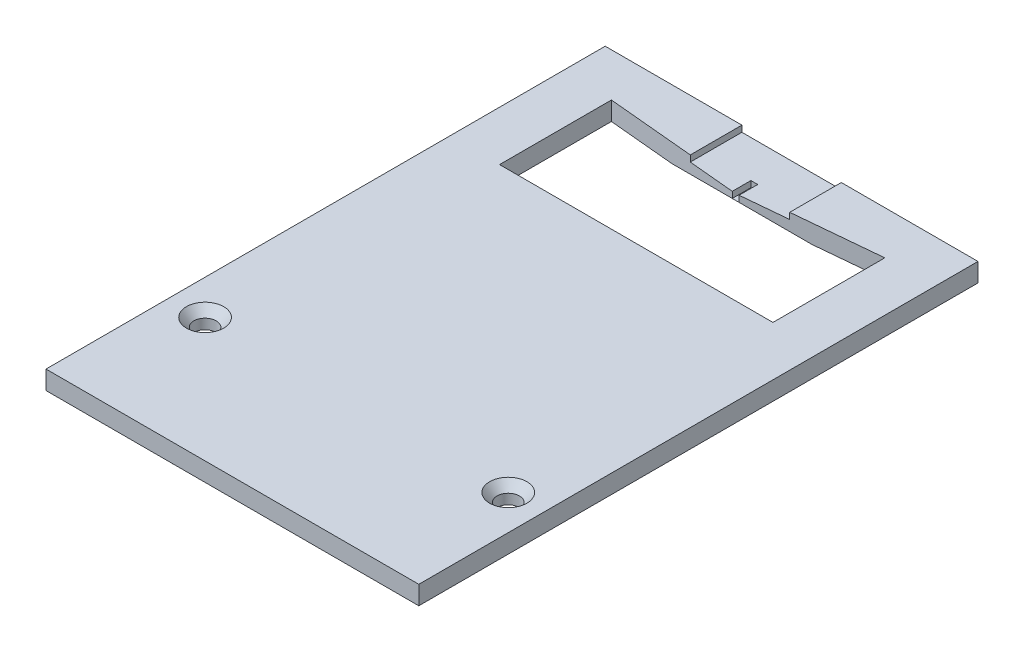
ISO-10303-21;
HEADER;
FILE_DESCRIPTION(('STEP AP214'),'2;1');
FILE_NAME('part.step','',(''),(''),'','','');
FILE_SCHEMA(('AUTOMOTIVE_DESIGN { 1 0 10303 214 1 1 1 1 }'));
ENDSEC;
DATA;
#1=APPLICATION_CONTEXT('core data for automotive mechanical design processes');
#2=APPLICATION_PROTOCOL_DEFINITION('international standard','automotive_design',2000,#1);
#3=PRODUCT_CONTEXT('',#1,'mechanical');
#4=PRODUCT('Part','Part','',(#3));
#5=PRODUCT_RELATED_PRODUCT_CATEGORY('part','',(#4));
#6=PRODUCT_DEFINITION_FORMATION('','',#4);
#7=PRODUCT_DEFINITION_CONTEXT('part definition',#1,'design');
#8=PRODUCT_DEFINITION('design','',#6,#7);
#9=PRODUCT_DEFINITION_SHAPE('','',#8);
#10=(LENGTH_UNIT() NAMED_UNIT(*) SI_UNIT(.MILLI.,.METRE.));
#11=(NAMED_UNIT(*) PLANE_ANGLE_UNIT() SI_UNIT($,.RADIAN.));
#12=(NAMED_UNIT(*) SI_UNIT($,.STERADIAN.) SOLID_ANGLE_UNIT());
#13=UNCERTAINTY_MEASURE_WITH_UNIT(LENGTH_MEASURE(1.E-05),#10,'distance_accuracy_value','');
#14=(GEOMETRIC_REPRESENTATION_CONTEXT(3) GLOBAL_UNCERTAINTY_ASSIGNED_CONTEXT((#13)) GLOBAL_UNIT_ASSIGNED_CONTEXT((#10,
#11,#12)) REPRESENTATION_CONTEXT('',''));
#15=CARTESIAN_POINT('',(0.,0.,0.));
#16=DIRECTION('',(0.,0.,1.));
#17=DIRECTION('',(1.,0.,0.));
#18=AXIS2_PLACEMENT_3D('',#15,#16,#17);
#19=CARTESIAN_POINT('',(0.,3.,0.));
#20=DIRECTION('',(0.,-1.,0.));
#21=DIRECTION('',(0.,0.,-1.));
#22=AXIS2_PLACEMENT_3D('',#19,#20,#21);
#23=PLANE('',#22);
#24=CARTESIAN_POINT('',(-24.4,3.,0.));
#25=DIRECTION('',(0.,1.,0.));
#26=DIRECTION('',(0.,0.,1.));
#27=AXIS2_PLACEMENT_3D('',#24,#25,#26);
#28=CIRCLE('',#27,3.);
#29=CARTESIAN_POINT('',(-24.4,3.,3.));
#30=VERTEX_POINT('',#29);
#31=EDGE_CURVE('E197',#30,#30,#28,.T.);
#32=ORIENTED_EDGE('',*,*,#31,.F.);
#33=EDGE_LOOP('',(#32));
#34=FACE_BOUND('',#33,.T.);
#35=CARTESIAN_POINT('',(24.4,3.,0.));
#36=DIRECTION('',(0.,1.,0.));
#37=DIRECTION('',(0.,0.,1.));
#38=AXIS2_PLACEMENT_3D('',#35,#36,#37);
#39=CIRCLE('',#38,3.);
#40=CARTESIAN_POINT('',(24.4,3.,3.));
#41=VERTEX_POINT('',#40);
#42=EDGE_CURVE('E200',#41,#41,#39,.T.);
#43=ORIENTED_EDGE('',*,*,#42,.F.);
#44=EDGE_LOOP('',(#43));
#45=FACE_BOUND('',#44,.T.);
#46=DIRECTION('',(-0.995681281474736,0.,0.09283741552212));
#47=VECTOR('',#46,1.);
#48=CARTESIAN_POINT('',(0.549999999999998,3.,-61.));
#49=LINE('',#48,#47);
#50=CARTESIAN_POINT('',(22.,3.,-63.));
#51=VERTEX_POINT('',#50);
#52=CARTESIAN_POINT('',(8.,3.,-61.6946386946387));
#53=VERTEX_POINT('',#52);
#54=EDGE_CURVE('E159',#51,#53,#49,.T.);
#55=ORIENTED_EDGE('',*,*,#54,.F.);
#56=DIRECTION('',(0.,0.,-1.));
#57=VECTOR('',#56,1.);
#58=CARTESIAN_POINT('',(22.,3.,-61.));
#59=LINE('',#58,#57);
#60=CARTESIAN_POINT('',(22.,3.,-45.));
#61=VERTEX_POINT('',#60);
#62=EDGE_CURVE('E254',#61,#51,#59,.T.);
#63=ORIENTED_EDGE('',*,*,#62,.F.);
#64=DIRECTION('',(1.,0.,0.));
#65=VECTOR('',#64,1.);
#66=CARTESIAN_POINT('',(-22.,3.,-45.));
#67=LINE('',#66,#65);
#68=CARTESIAN_POINT('',(-22.,3.,-45.));
#69=VERTEX_POINT('',#68);
#70=EDGE_CURVE('E251',#69,#61,#67,.T.);
#71=ORIENTED_EDGE('',*,*,#70,.F.);
#72=DIRECTION('',(0.,0.,1.));
#73=VECTOR('',#72,1.);
#74=CARTESIAN_POINT('',(-22.,3.,-61.));
#75=LINE('',#74,#73);
#76=CARTESIAN_POINT('',(-22.,3.,-63.));
#77=VERTEX_POINT('',#76);
#78=EDGE_CURVE('E249',#77,#69,#75,.T.);
#79=ORIENTED_EDGE('',*,*,#78,.F.);
#80=DIRECTION('',(-0.995681281474736,0.,-0.09283741552212));
#81=VECTOR('',#80,1.);
#82=CARTESIAN_POINT('',(-0.549999999999998,3.,-61.));
#83=LINE('',#82,#81);
#84=CARTESIAN_POINT('',(-8.,3.,-61.6946386946387));
#85=VERTEX_POINT('',#84);
#86=EDGE_CURVE('E175',#85,#77,#83,.T.);
#87=ORIENTED_EDGE('',*,*,#86,.F.);
#88=DIRECTION('',(0.,0.,1.));
#89=VECTOR('',#88,1.);
#90=CARTESIAN_POINT('',(-8.,3.,-61.));
#91=LINE('',#90,#89);
#92=CARTESIAN_POINT('',(-8.,3.,-70.));
#93=VERTEX_POINT('',#92);
#94=EDGE_CURVE('E225',#93,#85,#91,.T.);
#95=ORIENTED_EDGE('',*,*,#94,.F.);
#96=DIRECTION('',(-1.,0.,0.));
#97=VECTOR('',#96,1.);
#98=CARTESIAN_POINT('',(30.,3.,-70.));
#99=LINE('',#98,#97);
#100=CARTESIAN_POINT('',(-30.,3.,-70.));
#101=VERTEX_POINT('',#100);
#102=EDGE_CURVE('E274',#93,#101,#99,.T.);
#103=ORIENTED_EDGE('',*,*,#102,.T.);
#104=DIRECTION('',(0.,0.,1.));
#105=VECTOR('',#104,1.);
#106=CARTESIAN_POINT('',(-30.,3.,-20.));
#107=LINE('',#106,#105);
#108=CARTESIAN_POINT('',(-30.,3.,20.));
#109=VERTEX_POINT('',#108);
#110=EDGE_CURVE('E267',#101,#109,#107,.T.);
#111=ORIENTED_EDGE('',*,*,#110,.T.);
#112=DIRECTION('',(1.,0.,0.));
#113=VECTOR('',#112,1.);
#114=CARTESIAN_POINT('',(-30.,3.,20.));
#115=LINE('',#114,#113);
#116=CARTESIAN_POINT('',(30.,3.,20.));
#117=VERTEX_POINT('',#116);
#118=EDGE_CURVE('E269',#109,#117,#115,.T.);
#119=ORIENTED_EDGE('',*,*,#118,.T.);
#120=DIRECTION('',(0.,0.,-1.));
#121=VECTOR('',#120,1.);
#122=CARTESIAN_POINT('',(30.,3.,-20.));
#123=LINE('',#122,#121);
#124=CARTESIAN_POINT('',(30.,3.,-70.));
#125=VERTEX_POINT('',#124);
#126=EDGE_CURVE('E272',#117,#125,#123,.T.);
#127=ORIENTED_EDGE('',*,*,#126,.T.);
#128=CARTESIAN_POINT('',(8.,3.,-70.));
#129=VERTEX_POINT('',#128);
#130=EDGE_CURVE('E275',#125,#129,#99,.T.);
#131=ORIENTED_EDGE('',*,*,#130,.T.);
#132=DIRECTION('',(0.,0.,-1.));
#133=VECTOR('',#132,1.);
#134=CARTESIAN_POINT('',(8.,3.,-61.));
#135=LINE('',#134,#133);
#136=EDGE_CURVE('E235',#53,#129,#135,.T.);
#137=ORIENTED_EDGE('',*,*,#136,.F.);
#138=EDGE_LOOP('',(#55,#63,#71,#79,#87,#95,#103,#111,#119,#127,#131,#137));
#139=FACE_BOUND('',#138,.T.);
#140=ADVANCED_FACE('F35',(#34,#45,#139),#23,.F.);
#141=CARTESIAN_POINT('',(0.,0.,0.));
#142=DIRECTION('',(0.,-1.,0.));
#143=DIRECTION('',(0.,0.,-1.));
#144=AXIS2_PLACEMENT_3D('',#141,#142,#143);
#145=PLANE('',#144);
#146=DIRECTION('',(1.,0.,0.));
#147=VECTOR('',#146,1.);
#148=CARTESIAN_POINT('',(22.,0.,-62.));
#149=LINE('',#148,#147);
#150=CARTESIAN_POINT('',(-11.2749999999997,0.,-62.));
#151=VERTEX_POINT('',#150);
#152=CARTESIAN_POINT('',(11.2750000000001,0.,-62.));
#153=VERTEX_POINT('',#152);
#154=EDGE_CURVE('E50',#151,#153,#149,.T.);
#155=ORIENTED_EDGE('',*,*,#154,.F.);
#156=DIRECTION('',(-0.995681281474736,0.,-0.09283741552212));
#157=VECTOR('',#156,1.);
#158=CARTESIAN_POINT('',(-0.549999999999998,0.,-61.));
#159=LINE('',#158,#157);
#160=CARTESIAN_POINT('',(-22.,0.,-63.));
#161=VERTEX_POINT('',#160);
#162=EDGE_CURVE('E165',#151,#161,#159,.T.);
#163=ORIENTED_EDGE('',*,*,#162,.T.);
#164=DIRECTION('',(0.,0.,1.));
#165=VECTOR('',#164,1.);
#166=CARTESIAN_POINT('',(-22.,0.,-61.));
#167=LINE('',#166,#165);
#168=CARTESIAN_POINT('',(-22.,0.,-45.));
#169=VERTEX_POINT('',#168);
#170=EDGE_CURVE('E246',#161,#169,#167,.T.);
#171=ORIENTED_EDGE('',*,*,#170,.T.);
#172=DIRECTION('',(1.,0.,0.));
#173=VECTOR('',#172,1.);
#174=CARTESIAN_POINT('',(-22.,0.,-45.));
#175=LINE('',#174,#173);
#176=CARTESIAN_POINT('',(22.,0.,-45.));
#177=VERTEX_POINT('',#176);
#178=EDGE_CURVE('E258',#169,#177,#175,.T.);
#179=ORIENTED_EDGE('',*,*,#178,.T.);
#180=DIRECTION('',(0.,0.,-1.));
#181=VECTOR('',#180,1.);
#182=CARTESIAN_POINT('',(22.,0.,-61.));
#183=LINE('',#182,#181);
#184=CARTESIAN_POINT('',(22.,0.,-63.));
#185=VERTEX_POINT('',#184);
#186=EDGE_CURVE('E252',#177,#185,#183,.T.);
#187=ORIENTED_EDGE('',*,*,#186,.T.);
#188=DIRECTION('',(-0.995681281474736,0.,0.09283741552212));
#189=VECTOR('',#188,1.);
#190=CARTESIAN_POINT('',(0.549999999999998,0.,-61.));
#191=LINE('',#190,#189);
#192=EDGE_CURVE('E168',#185,#153,#191,.T.);
#193=ORIENTED_EDGE('',*,*,#192,.T.);
#194=EDGE_LOOP('',(#155,#163,#171,#179,#187,#193));
#195=FACE_BOUND('',#194,.T.);
#196=CARTESIAN_POINT('',(24.4,0.,0.));
#197=DIRECTION('',(0.,1.,0.));
#198=DIRECTION('',(0.,0.,1.));
#199=AXIS2_PLACEMENT_3D('',#196,#197,#198);
#200=CIRCLE('',#199,1.8);
#201=CARTESIAN_POINT('',(24.4,0.,1.8));
#202=VERTEX_POINT('',#201);
#203=EDGE_CURVE('E189',#202,#202,#200,.T.);
#204=ORIENTED_EDGE('',*,*,#203,.T.);
#205=EDGE_LOOP('',(#204));
#206=FACE_BOUND('',#205,.T.);
#207=CARTESIAN_POINT('',(-24.4,0.,0.));
#208=DIRECTION('',(0.,1.,0.));
#209=DIRECTION('',(0.,0.,1.));
#210=AXIS2_PLACEMENT_3D('',#207,#208,#209);
#211=CIRCLE('',#210,1.8);
#212=CARTESIAN_POINT('',(-24.4,0.,1.8));
#213=VERTEX_POINT('',#212);
#214=EDGE_CURVE('E193',#213,#213,#211,.T.);
#215=ORIENTED_EDGE('',*,*,#214,.T.);
#216=EDGE_LOOP('',(#215));
#217=FACE_BOUND('',#216,.T.);
#218=DIRECTION('',(0.,0.,1.));
#219=VECTOR('',#218,1.);
#220=CARTESIAN_POINT('',(-30.,0.,-20.));
#221=LINE('',#220,#219);
#222=CARTESIAN_POINT('',(-30.,0.,-70.));
#223=VERTEX_POINT('',#222);
#224=CARTESIAN_POINT('',(-30.,0.,20.));
#225=VERTEX_POINT('',#224);
#226=EDGE_CURVE('E266',#223,#225,#221,.T.);
#227=ORIENTED_EDGE('',*,*,#226,.F.);
#228=DIRECTION('',(-1.,0.,0.));
#229=VECTOR('',#228,1.);
#230=CARTESIAN_POINT('',(-30.,0.,-70.));
#231=LINE('',#230,#229);
#232=CARTESIAN_POINT('',(30.,0.,-70.));
#233=VERTEX_POINT('',#232);
#234=EDGE_CURVE('E270',#233,#223,#231,.T.);
#235=ORIENTED_EDGE('',*,*,#234,.F.);
#236=DIRECTION('',(0.,0.,-1.));
#237=VECTOR('',#236,1.);
#238=CARTESIAN_POINT('',(30.,0.,-20.));
#239=LINE('',#238,#237);
#240=CARTESIAN_POINT('',(30.,0.,20.));
#241=VERTEX_POINT('',#240);
#242=EDGE_CURVE('E283',#241,#233,#239,.T.);
#243=ORIENTED_EDGE('',*,*,#242,.F.);
#244=DIRECTION('',(1.,0.,0.));
#245=VECTOR('',#244,1.);
#246=CARTESIAN_POINT('',(-30.,0.,20.));
#247=LINE('',#246,#245);
#248=EDGE_CURVE('E280',#225,#241,#247,.T.);
#249=ORIENTED_EDGE('',*,*,#248,.F.);
#250=EDGE_LOOP('',(#227,#235,#243,#249));
#251=FACE_BOUND('',#250,.T.);
#252=ADVANCED_FACE('F163',(#195,#206,#217,#251),#145,.T.);
#253=CARTESIAN_POINT('',(-30.,3.,-20.));
#254=DIRECTION('',(1.,0.,0.));
#255=DIRECTION('',(0.,0.,-1.));
#256=AXIS2_PLACEMENT_3D('',#253,#254,#255);
#257=PLANE('',#256);
#258=ORIENTED_EDGE('',*,*,#226,.T.);
#259=DIRECTION('',(0.,-1.,0.));
#260=VECTOR('',#259,1.);
#261=CARTESIAN_POINT('',(-30.,3.,20.));
#262=LINE('',#261,#260);
#263=EDGE_CURVE('E43',#109,#225,#262,.T.);
#264=ORIENTED_EDGE('',*,*,#263,.F.);
#265=ORIENTED_EDGE('',*,*,#110,.F.);
#266=DIRECTION('',(0.,-1.,0.));
#267=VECTOR('',#266,1.);
#268=CARTESIAN_POINT('',(-30.,3.,-70.));
#269=LINE('',#268,#267);
#270=EDGE_CURVE('E278',#101,#223,#269,.T.);
#271=ORIENTED_EDGE('',*,*,#270,.T.);
#272=EDGE_LOOP('',(#258,#264,#265,#271));
#273=FACE_BOUND('',#272,.T.);
#274=ADVANCED_FACE('F37',(#273),#257,.F.);
#275=CARTESIAN_POINT('',(-30.,3.,20.));
#276=DIRECTION('',(0.,0.,-1.));
#277=DIRECTION('',(-1.,0.,0.));
#278=AXIS2_PLACEMENT_3D('',#275,#276,#277);
#279=PLANE('',#278);
#280=ORIENTED_EDGE('',*,*,#248,.T.);
#281=DIRECTION('',(0.,-1.,0.));
#282=VECTOR('',#281,1.);
#283=CARTESIAN_POINT('',(30.,3.,20.));
#284=LINE('',#283,#282);
#285=EDGE_CURVE('E293',#117,#241,#284,.T.);
#286=ORIENTED_EDGE('',*,*,#285,.F.);
#287=ORIENTED_EDGE('',*,*,#118,.F.);
#288=ORIENTED_EDGE('',*,*,#263,.T.);
#289=EDGE_LOOP('',(#280,#286,#287,#288));
#290=FACE_BOUND('',#289,.T.);
#291=ADVANCED_FACE('F339',(#290),#279,.F.);
#292=CARTESIAN_POINT('',(30.,3.,-20.));
#293=DIRECTION('',(-1.,0.,0.));
#294=DIRECTION('',(0.,0.,1.));
#295=AXIS2_PLACEMENT_3D('',#292,#293,#294);
#296=PLANE('',#295);
#297=ORIENTED_EDGE('',*,*,#242,.T.);
#298=DIRECTION('',(0.,-1.,0.));
#299=VECTOR('',#298,1.);
#300=CARTESIAN_POINT('',(30.,3.,-70.));
#301=LINE('',#300,#299);
#302=EDGE_CURVE('E290',#125,#233,#301,.T.);
#303=ORIENTED_EDGE('',*,*,#302,.F.);
#304=ORIENTED_EDGE('',*,*,#126,.F.);
#305=ORIENTED_EDGE('',*,*,#285,.T.);
#306=EDGE_LOOP('',(#297,#303,#304,#305));
#307=FACE_BOUND('',#306,.T.);
#308=ADVANCED_FACE('F336',(#307),#296,.F.);
#309=CARTESIAN_POINT('',(-30.,3.,-70.));
#310=DIRECTION('',(0.,0.,1.));
#311=DIRECTION('',(1.,0.,0.));
#312=AXIS2_PLACEMENT_3D('',#309,#310,#311);
#313=PLANE('',#312);
#314=ORIENTED_EDGE('',*,*,#102,.F.);
#315=DIRECTION('',(0.,1.,0.));
#316=VECTOR('',#315,1.);
#317=CARTESIAN_POINT('',(-8.,2.,-70.));
#318=LINE('',#317,#316);
#319=CARTESIAN_POINT('',(-8.,2.,-70.));
#320=VERTEX_POINT('',#319);
#321=EDGE_CURVE('E244',#320,#93,#318,.T.);
#322=ORIENTED_EDGE('',*,*,#321,.F.);
#323=DIRECTION('',(-1.,0.,0.));
#324=VECTOR('',#323,1.);
#325=CARTESIAN_POINT('',(-8.,2.,-70.));
#326=LINE('',#325,#324);
#327=CARTESIAN_POINT('',(8.,2.,-70.));
#328=VERTEX_POINT('',#327);
#329=EDGE_CURVE('E237',#328,#320,#326,.T.);
#330=ORIENTED_EDGE('',*,*,#329,.F.);
#331=DIRECTION('',(0.,1.,0.));
#332=VECTOR('',#331,1.);
#333=CARTESIAN_POINT('',(8.,2.,-70.));
#334=LINE('',#333,#332);
#335=EDGE_CURVE('E240',#328,#129,#334,.T.);
#336=ORIENTED_EDGE('',*,*,#335,.T.);
#337=ORIENTED_EDGE('',*,*,#130,.F.);
#338=ORIENTED_EDGE('',*,*,#302,.T.);
#339=ORIENTED_EDGE('',*,*,#234,.T.);
#340=ORIENTED_EDGE('',*,*,#270,.F.);
#341=EDGE_LOOP('',(#314,#322,#330,#336,#337,#338,#339,#340));
#342=FACE_BOUND('',#341,.T.);
#343=ADVANCED_FACE('F333',(#342),#313,.F.);
#344=CARTESIAN_POINT('',(-22.,3.,-61.));
#345=DIRECTION('',(1.,0.,0.));
#346=DIRECTION('',(0.,0.,-1.));
#347=AXIS2_PLACEMENT_3D('',#344,#345,#346);
#348=PLANE('',#347);
#349=ORIENTED_EDGE('',*,*,#170,.F.);
#350=DIRECTION('',(0.,1.,0.));
#351=VECTOR('',#350,1.);
#352=CARTESIAN_POINT('',(-22.,0.,-63.));
#353=LINE('',#352,#351);
#354=EDGE_CURVE('E174',#161,#77,#353,.T.);
#355=ORIENTED_EDGE('',*,*,#354,.T.);
#356=ORIENTED_EDGE('',*,*,#78,.T.);
#357=DIRECTION('',(0.,-1.,0.));
#358=VECTOR('',#357,1.);
#359=CARTESIAN_POINT('',(-22.,3.,-45.));
#360=LINE('',#359,#358);
#361=EDGE_CURVE('E263',#69,#169,#360,.T.);
#362=ORIENTED_EDGE('',*,*,#361,.T.);
#363=EDGE_LOOP('',(#349,#355,#356,#362));
#364=FACE_BOUND('',#363,.T.);
#365=ADVANCED_FACE('F330',(#364),#348,.T.);
#366=CARTESIAN_POINT('',(-22.,3.,-45.));
#367=DIRECTION('',(0.,0.,-1.));
#368=DIRECTION('',(-1.,0.,0.));
#369=AXIS2_PLACEMENT_3D('',#366,#367,#368);
#370=PLANE('',#369);
#371=ORIENTED_EDGE('',*,*,#178,.F.);
#372=ORIENTED_EDGE('',*,*,#361,.F.);
#373=ORIENTED_EDGE('',*,*,#70,.T.);
#374=DIRECTION('',(0.,-1.,0.));
#375=VECTOR('',#374,1.);
#376=CARTESIAN_POINT('',(22.,3.,-45.));
#377=LINE('',#376,#375);
#378=EDGE_CURVE('E256',#61,#177,#377,.T.);
#379=ORIENTED_EDGE('',*,*,#378,.T.);
#380=EDGE_LOOP('',(#371,#372,#373,#379));
#381=FACE_BOUND('',#380,.T.);
#382=ADVANCED_FACE('F391',(#381),#370,.T.);
#383=CARTESIAN_POINT('',(22.,3.,-61.));
#384=DIRECTION('',(-1.,0.,0.));
#385=DIRECTION('',(0.,0.,1.));
#386=AXIS2_PLACEMENT_3D('',#383,#384,#385);
#387=PLANE('',#386);
#388=ORIENTED_EDGE('',*,*,#186,.F.);
#389=ORIENTED_EDGE('',*,*,#378,.F.);
#390=ORIENTED_EDGE('',*,*,#62,.T.);
#391=DIRECTION('',(0.,1.,0.));
#392=VECTOR('',#391,1.);
#393=CARTESIAN_POINT('',(22.,0.,-63.));
#394=LINE('',#393,#392);
#395=EDGE_CURVE('E373',#185,#51,#394,.T.);
#396=ORIENTED_EDGE('',*,*,#395,.F.);
#397=EDGE_LOOP('',(#388,#389,#390,#396));
#398=FACE_BOUND('',#397,.T.);
#399=ADVANCED_FACE('F387',(#398),#387,.T.);
#400=CARTESIAN_POINT('',(-8.,2.,-61.));
#401=DIRECTION('',(-1.,0.,0.));
#402=DIRECTION('',(0.,0.,1.));
#403=AXIS2_PLACEMENT_3D('',#400,#401,#402);
#404=PLANE('',#403);
#405=ORIENTED_EDGE('',*,*,#94,.T.);
#406=DIRECTION('',(0.,-1.,0.));
#407=VECTOR('',#406,1.);
#408=CARTESIAN_POINT('',(-8.,2.,-61.6946386946387));
#409=LINE('',#408,#407);
#410=CARTESIAN_POINT('',(-8.,2.,-61.6946386946387));
#411=VERTEX_POINT('',#410);
#412=EDGE_CURVE('E186',#85,#411,#409,.T.);
#413=ORIENTED_EDGE('',*,*,#412,.T.);
#414=DIRECTION('',(0.,0.,1.));
#415=VECTOR('',#414,1.);
#416=CARTESIAN_POINT('',(-8.,2.,-61.));
#417=LINE('',#416,#415);
#418=EDGE_CURVE('E231',#320,#411,#417,.T.);
#419=ORIENTED_EDGE('',*,*,#418,.F.);
#420=ORIENTED_EDGE('',*,*,#321,.T.);
#421=EDGE_LOOP('',(#405,#413,#419,#420));
#422=FACE_BOUND('',#421,.T.);
#423=ADVANCED_FACE('F402',(#422),#404,.F.);
#424=CARTESIAN_POINT('',(8.,2.,-61.));
#425=DIRECTION('',(1.,0.,0.));
#426=DIRECTION('',(0.,0.,-1.));
#427=AXIS2_PLACEMENT_3D('',#424,#425,#426);
#428=PLANE('',#427);
#429=DIRECTION('',(0.,0.,-1.));
#430=VECTOR('',#429,1.);
#431=CARTESIAN_POINT('',(8.,2.,-61.));
#432=LINE('',#431,#430);
#433=CARTESIAN_POINT('',(8.,2.,-61.6946386946387));
#434=VERTEX_POINT('',#433);
#435=EDGE_CURVE('E234',#434,#328,#432,.T.);
#436=ORIENTED_EDGE('',*,*,#435,.F.);
#437=DIRECTION('',(0.,1.,0.));
#438=VECTOR('',#437,1.);
#439=CARTESIAN_POINT('',(8.,2.,-61.6946386946387));
#440=LINE('',#439,#438);
#441=EDGE_CURVE('E179',#434,#53,#440,.T.);
#442=ORIENTED_EDGE('',*,*,#441,.T.);
#443=ORIENTED_EDGE('',*,*,#136,.T.);
#444=ORIENTED_EDGE('',*,*,#335,.F.);
#445=EDGE_LOOP('',(#436,#442,#443,#444));
#446=FACE_BOUND('',#445,.T.);
#447=ADVANCED_FACE('F367',(#446),#428,.F.);
#448=CARTESIAN_POINT('',(0.,2.,0.));
#449=DIRECTION('',(0.,-1.,0.));
#450=DIRECTION('',(0.,0.,-1.));
#451=AXIS2_PLACEMENT_3D('',#448,#449,#450);
#452=PLANE('',#451);
#453=DIRECTION('',(0.,0.,-1.));
#454=VECTOR('',#453,1.);
#455=CARTESIAN_POINT('',(0.55,2.,-64.));
#456=LINE('',#455,#454);
#457=CARTESIAN_POINT('',(0.55,2.,-61.));
#458=VERTEX_POINT('',#457);
#459=CARTESIAN_POINT('',(0.55,2.,-64.));
#460=VERTEX_POINT('',#459);
#461=EDGE_CURVE('E218',#458,#460,#456,.T.);
#462=ORIENTED_EDGE('',*,*,#461,.F.);
#463=DIRECTION('',(0.995681281474736,0.,-0.09283741552212));
#464=VECTOR('',#463,1.);
#465=CARTESIAN_POINT('',(-5.63388475606143,2.,-60.4234140087588));
#466=LINE('',#465,#464);
#467=EDGE_CURVE('E57',#458,#434,#466,.T.);
#468=ORIENTED_EDGE('',*,*,#467,.T.);
#469=ORIENTED_EDGE('',*,*,#435,.T.);
#470=ORIENTED_EDGE('',*,*,#329,.T.);
#471=ORIENTED_EDGE('',*,*,#418,.T.);
#472=DIRECTION('',(0.995681281474736,0.,0.09283741552212));
#473=VECTOR('',#472,1.);
#474=CARTESIAN_POINT('',(5.63388475606143,2.,-60.4234140087588));
#475=LINE('',#474,#473);
#476=CARTESIAN_POINT('',(-0.549999999999998,2.,-61.));
#477=VERTEX_POINT('',#476);
#478=EDGE_CURVE('E177',#411,#477,#475,.T.);
#479=ORIENTED_EDGE('',*,*,#478,.T.);
#480=DIRECTION('',(0.,0.,1.));
#481=VECTOR('',#480,1.);
#482=CARTESIAN_POINT('',(-0.550000000000001,2.,-64.));
#483=LINE('',#482,#481);
#484=CARTESIAN_POINT('',(-0.550000000000001,2.,-64.));
#485=VERTEX_POINT('',#484);
#486=EDGE_CURVE('E203',#485,#477,#483,.T.);
#487=ORIENTED_EDGE('',*,*,#486,.F.);
#488=DIRECTION('',(-1.,0.,0.));
#489=VECTOR('',#488,1.);
#490=CARTESIAN_POINT('',(-0.550000000000001,2.,-64.));
#491=LINE('',#490,#489);
#492=EDGE_CURVE('E207',#460,#485,#491,.T.);
#493=ORIENTED_EDGE('',*,*,#492,.F.);
#494=EDGE_LOOP('',(#462,#468,#469,#470,#471,#479,#487,#493));
#495=FACE_BOUND('',#494,.T.);
#496=ADVANCED_FACE('F378',(#495),#452,.F.);
#497=CARTESIAN_POINT('',(-0.550000000000001,1.,-64.));
#498=DIRECTION('',(-1.,0.,0.));
#499=DIRECTION('',(0.,0.,1.));
#500=AXIS2_PLACEMENT_3D('',#497,#498,#499);
#501=PLANE('',#500);
#502=ORIENTED_EDGE('',*,*,#486,.T.);
#503=DIRECTION('',(0.,1.,0.));
#504=VECTOR('',#503,1.);
#505=CARTESIAN_POINT('',(-0.55,1.,-61.));
#506=LINE('',#505,#504);
#507=CARTESIAN_POINT('',(-0.550000000000049,0.999999999999998,-61.));
#508=VERTEX_POINT('',#507);
#509=EDGE_CURVE('E215',#508,#477,#506,.T.);
#510=ORIENTED_EDGE('',*,*,#509,.F.);
#511=DIRECTION('',(0.,0.,1.));
#512=VECTOR('',#511,1.);
#513=CARTESIAN_POINT('',(-0.550000000000001,1.,-64.));
#514=LINE('',#513,#512);
#515=CARTESIAN_POINT('',(-0.550000000000001,1.,-64.));
#516=VERTEX_POINT('',#515);
#517=EDGE_CURVE('E204',#516,#508,#514,.T.);
#518=ORIENTED_EDGE('',*,*,#517,.F.);
#519=DIRECTION('',(0.,1.,0.));
#520=VECTOR('',#519,1.);
#521=CARTESIAN_POINT('',(-0.550000000000001,1.,-64.));
#522=LINE('',#521,#520);
#523=EDGE_CURVE('E223',#516,#485,#522,.T.);
#524=ORIENTED_EDGE('',*,*,#523,.T.);
#525=EDGE_LOOP('',(#502,#510,#518,#524));
#526=FACE_BOUND('',#525,.T.);
#527=ADVANCED_FACE('F412',(#526),#501,.F.);
#528=CARTESIAN_POINT('',(-0.550000000000001,1.,-64.));
#529=DIRECTION('',(0.,0.,-1.));
#530=DIRECTION('',(-1.,0.,0.));
#531=AXIS2_PLACEMENT_3D('',#528,#529,#530);
#532=PLANE('',#531);
#533=ORIENTED_EDGE('',*,*,#492,.T.);
#534=ORIENTED_EDGE('',*,*,#523,.F.);
#535=DIRECTION('',(-1.,0.,0.));
#536=VECTOR('',#535,1.);
#537=CARTESIAN_POINT('',(-0.550000000000001,1.,-64.));
#538=LINE('',#537,#536);
#539=CARTESIAN_POINT('',(0.55,1.,-64.));
#540=VERTEX_POINT('',#539);
#541=EDGE_CURVE('E212',#540,#516,#538,.T.);
#542=ORIENTED_EDGE('',*,*,#541,.F.);
#543=DIRECTION('',(0.,1.,0.));
#544=VECTOR('',#543,1.);
#545=CARTESIAN_POINT('',(0.55,1.,-64.));
#546=LINE('',#545,#544);
#547=EDGE_CURVE('E226',#540,#460,#546,.T.);
#548=ORIENTED_EDGE('',*,*,#547,.T.);
#549=EDGE_LOOP('',(#533,#534,#542,#548));
#550=FACE_BOUND('',#549,.T.);
#551=ADVANCED_FACE('F415',(#550),#532,.F.);
#552=CARTESIAN_POINT('',(0.55,1.,-64.));
#553=DIRECTION('',(1.,0.,0.));
#554=DIRECTION('',(0.,0.,-1.));
#555=AXIS2_PLACEMENT_3D('',#552,#553,#554);
#556=PLANE('',#555);
#557=ORIENTED_EDGE('',*,*,#461,.T.);
#558=ORIENTED_EDGE('',*,*,#547,.F.);
#559=DIRECTION('',(0.,0.,-1.));
#560=VECTOR('',#559,1.);
#561=CARTESIAN_POINT('',(0.55,1.,-64.));
#562=LINE('',#561,#560);
#563=CARTESIAN_POINT('',(0.550000000000046,0.999999999999998,-61.));
#564=VERTEX_POINT('',#563);
#565=EDGE_CURVE('E209',#564,#540,#562,.T.);
#566=ORIENTED_EDGE('',*,*,#565,.F.);
#567=DIRECTION('',(0.,1.,0.));
#568=VECTOR('',#567,1.);
#569=CARTESIAN_POINT('',(0.55,1.,-61.));
#570=LINE('',#569,#568);
#571=EDGE_CURVE('E228',#564,#458,#570,.T.);
#572=ORIENTED_EDGE('',*,*,#571,.T.);
#573=EDGE_LOOP('',(#557,#558,#566,#572));
#574=FACE_BOUND('',#573,.T.);
#575=ADVANCED_FACE('F382',(#574),#556,.F.);
#576=CARTESIAN_POINT('',(0.,1.,0.));
#577=DIRECTION('',(0.,1.,0.));
#578=DIRECTION('',(0.,0.,1.));
#579=AXIS2_PLACEMENT_3D('',#576,#577,#578);
#580=PLANE('',#579);
#581=ORIENTED_EDGE('',*,*,#517,.T.);
#582=DIRECTION('',(1.,0.,0.));
#583=VECTOR('',#582,1.);
#584=CARTESIAN_POINT('',(-0.55,1.,-61.));
#585=LINE('',#584,#583);
#586=EDGE_CURVE('E155',#508,#564,#585,.T.);
#587=ORIENTED_EDGE('',*,*,#586,.T.);
#588=ORIENTED_EDGE('',*,*,#565,.T.);
#589=ORIENTED_EDGE('',*,*,#541,.T.);
#590=EDGE_LOOP('',(#581,#587,#588,#589));
#591=FACE_BOUND('',#590,.T.);
#592=ADVANCED_FACE('F419',(#591),#580,.T.);
#593=CARTESIAN_POINT('',(24.4,3.,0.));
#594=DIRECTION('',(0.,1.,0.));
#595=DIRECTION('',(0.,0.,1.));
#596=AXIS2_PLACEMENT_3D('',#593,#594,#595);
#597=CONICAL_SURFACE('',#596,3.,0.715584993317677);
#598=CARTESIAN_POINT('',(24.4,1.61955791133479,0.));
#599=DIRECTION('',(0.,1.,0.));
#600=DIRECTION('',(0.,0.,1.));
#601=AXIS2_PLACEMENT_3D('',#598,#599,#600);
#602=CIRCLE('',#601,1.8);
#603=CARTESIAN_POINT('',(24.4,1.61955791133479,1.8));
#604=VERTEX_POINT('',#603);
#605=EDGE_CURVE('E192',#604,#604,#602,.F.);
#606=ORIENTED_EDGE('',*,*,#605,.T.);
#607=EDGE_LOOP('',(#606));
#608=FACE_BOUND('',#607,.T.);
#609=ORIENTED_EDGE('',*,*,#42,.T.);
#610=EDGE_LOOP('',(#609));
#611=FACE_BOUND('',#610,.T.);
#612=ADVANCED_FACE('F302',(#608,#611),#597,.F.);
#613=CARTESIAN_POINT('',(-24.4,3.,0.));
#614=DIRECTION('',(0.,1.,0.));
#615=DIRECTION('',(0.,0.,1.));
#616=AXIS2_PLACEMENT_3D('',#613,#614,#615);
#617=CONICAL_SURFACE('',#616,3.,0.715584993317677);
#618=CARTESIAN_POINT('',(-24.4,1.61955791133479,0.));
#619=DIRECTION('',(0.,1.,0.));
#620=DIRECTION('',(0.,0.,1.));
#621=AXIS2_PLACEMENT_3D('',#618,#619,#620);
#622=CIRCLE('',#621,1.8);
#623=CARTESIAN_POINT('',(-24.4,1.61955791133479,1.8));
#624=VERTEX_POINT('',#623);
#625=EDGE_CURVE('E196',#624,#624,#622,.F.);
#626=ORIENTED_EDGE('',*,*,#625,.T.);
#627=EDGE_LOOP('',(#626));
#628=FACE_BOUND('',#627,.T.);
#629=ORIENTED_EDGE('',*,*,#31,.T.);
#630=EDGE_LOOP('',(#629));
#631=FACE_BOUND('',#630,.T.);
#632=ADVANCED_FACE('F316',(#628,#631),#617,.F.);
#633=CARTESIAN_POINT('',(-24.4,0.,0.));
#634=DIRECTION('',(0.,1.,0.));
#635=DIRECTION('',(0.,0.,1.));
#636=AXIS2_PLACEMENT_3D('',#633,#634,#635);
#637=CYLINDRICAL_SURFACE('',#636,1.8);
#638=ORIENTED_EDGE('',*,*,#214,.F.);
#639=EDGE_LOOP('',(#638));
#640=FACE_BOUND('',#639,.T.);
#641=ORIENTED_EDGE('',*,*,#625,.F.);
#642=EDGE_LOOP('',(#641));
#643=FACE_BOUND('',#642,.T.);
#644=ADVANCED_FACE('F307',(#640,#643),#637,.F.);
#645=CARTESIAN_POINT('',(24.4,0.,0.));
#646=DIRECTION('',(0.,1.,0.));
#647=DIRECTION('',(0.,0.,1.));
#648=AXIS2_PLACEMENT_3D('',#645,#646,#647);
#649=CYLINDRICAL_SURFACE('',#648,1.8);
#650=ORIENTED_EDGE('',*,*,#203,.F.);
#651=EDGE_LOOP('',(#650));
#652=FACE_BOUND('',#651,.T.);
#653=ORIENTED_EDGE('',*,*,#605,.F.);
#654=EDGE_LOOP('',(#653));
#655=FACE_BOUND('',#654,.T.);
#656=ADVANCED_FACE('F305',(#652,#655),#649,.F.);
#657=CARTESIAN_POINT('',(-0.549999999999998,0.,-61.));
#658=DIRECTION('',(0.09283741552212,0.,-0.995681281474736));
#659=DIRECTION('',(-0.995681281474736,0.,-0.09283741552212));
#660=AXIS2_PLACEMENT_3D('',#657,#658,#659);
#661=PLANE('',#660);
#662=ORIENTED_EDGE('',*,*,#162,.F.);
#663=DIRECTION('',(0.991418037947735,0.0924399102981567,0.0924399102981572));
#664=VECTOR('',#663,1.);
#665=CARTESIAN_POINT('',(-0.641646594495862,0.991454862984069,-61.0085451370159));
#666=LINE('',#665,#664);
#667=EDGE_CURVE('E152',#151,#508,#666,.T.);
#668=ORIENTED_EDGE('',*,*,#667,.T.);
#669=ORIENTED_EDGE('',*,*,#509,.T.);
#670=ORIENTED_EDGE('',*,*,#478,.F.);
#671=ORIENTED_EDGE('',*,*,#412,.F.);
#672=ORIENTED_EDGE('',*,*,#86,.T.);
#673=ORIENTED_EDGE('',*,*,#354,.F.);
#674=EDGE_LOOP('',(#662,#668,#669,#670,#671,#672,#673));
#675=FACE_BOUND('',#674,.T.);
#676=ADVANCED_FACE('F171',(#675),#661,.F.);
#677=CARTESIAN_POINT('',(0.549999999999998,0.,-61.));
#678=DIRECTION('',(-0.09283741552212,0.,-0.995681281474736));
#679=DIRECTION('',(-0.995681281474736,0.,0.09283741552212));
#680=AXIS2_PLACEMENT_3D('',#677,#678,#679);
#681=PLANE('',#680);
#682=ORIENTED_EDGE('',*,*,#571,.F.);
#683=DIRECTION('',(0.991418037947735,-0.092439910298157,-0.0924399102981572));
#684=VECTOR('',#683,1.);
#685=CARTESIAN_POINT('',(0.641646594495862,0.991454862984069,-61.0085451370159));
#686=LINE('',#685,#684);
#687=EDGE_CURVE('E11',#564,#153,#686,.T.);
#688=ORIENTED_EDGE('',*,*,#687,.T.);
#689=ORIENTED_EDGE('',*,*,#192,.F.);
#690=ORIENTED_EDGE('',*,*,#395,.T.);
#691=ORIENTED_EDGE('',*,*,#54,.T.);
#692=ORIENTED_EDGE('',*,*,#441,.F.);
#693=ORIENTED_EDGE('',*,*,#467,.F.);
#694=EDGE_LOOP('',(#682,#688,#689,#690,#691,#692,#693));
#695=FACE_BOUND('',#694,.T.);
#696=ADVANCED_FACE('F314',(#695),#681,.F.);
#697=CARTESIAN_POINT('',(22.,0.,-62.));
#698=DIRECTION('',(0.,0.707106781186549,-0.707106781186546));
#699=DIRECTION('',(0.,0.707106781186546,0.707106781186549));
#700=AXIS2_PLACEMENT_3D('',#697,#698,#699);
#701=PLANE('',#700);
#702=ORIENTED_EDGE('',*,*,#154,.T.);
#703=ORIENTED_EDGE('',*,*,#687,.F.);
#704=ORIENTED_EDGE('',*,*,#586,.F.);
#705=ORIENTED_EDGE('',*,*,#667,.F.);
#706=EDGE_LOOP('',(#702,#703,#704,#705));
#707=FACE_BOUND('',#706,.T.);
#708=ADVANCED_FACE('F153',(#707),#701,.F.);
#709=CLOSED_SHELL('',(#140,#252,#274,#291,#308,#343,#365,#382,#399,#423,#447,#496,#527,#551,
#575,#592,#612,#632,#644,#656,#676,#696,#708));
#710=MANIFOLD_SOLID_BREP('B2',#709);
#711=ADVANCED_BREP_SHAPE_REPRESENTATION('',(#18,#710),#14);
#712=SHAPE_DEFINITION_REPRESENTATION(#9,#711);
ENDSEC;
END-ISO-10303-21;
